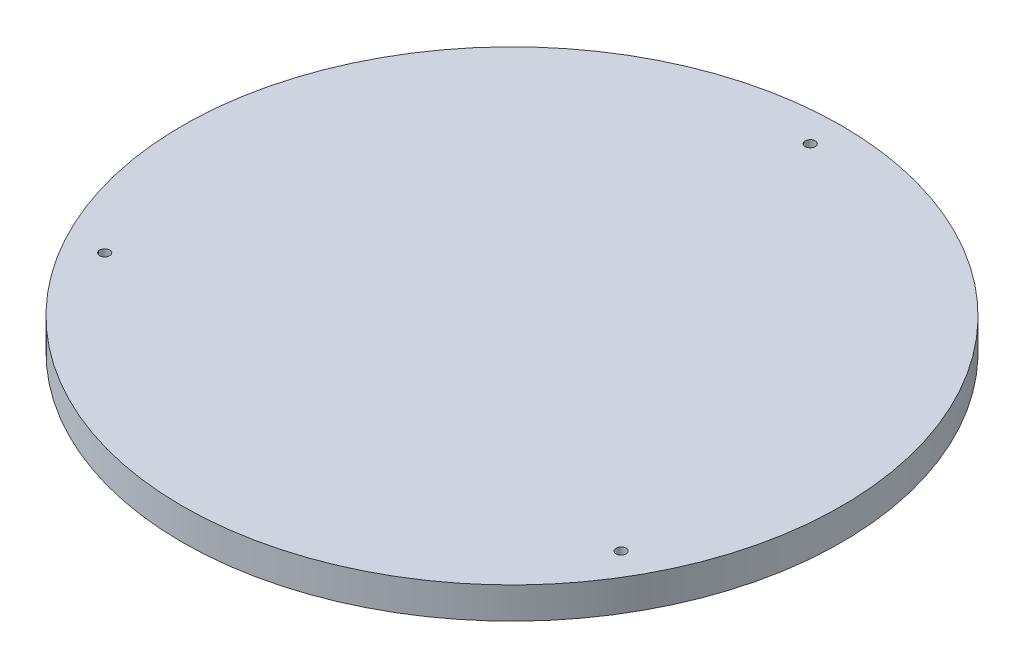
ISO-10303-21;
HEADER;
FILE_DESCRIPTION(('STEP AP214'),'2;1');
FILE_NAME('part.step','',(''),(''),'','','');
FILE_SCHEMA(('AUTOMOTIVE_DESIGN { 1 0 10303 214 1 1 1 1 }'));
ENDSEC;
DATA;
#1=APPLICATION_CONTEXT('core data for automotive mechanical design processes');
#2=APPLICATION_PROTOCOL_DEFINITION('international standard','automotive_design',2000,#1);
#3=PRODUCT_CONTEXT('',#1,'mechanical');
#4=PRODUCT('Part','Part','',(#3));
#5=PRODUCT_RELATED_PRODUCT_CATEGORY('part','',(#4));
#6=PRODUCT_DEFINITION_FORMATION('','',#4);
#7=PRODUCT_DEFINITION_CONTEXT('part definition',#1,'design');
#8=PRODUCT_DEFINITION('design','',#6,#7);
#9=PRODUCT_DEFINITION_SHAPE('','',#8);
#10=(LENGTH_UNIT() NAMED_UNIT(*) SI_UNIT(.MILLI.,.METRE.));
#11=(NAMED_UNIT(*) PLANE_ANGLE_UNIT() SI_UNIT($,.RADIAN.));
#12=(NAMED_UNIT(*) SI_UNIT($,.STERADIAN.) SOLID_ANGLE_UNIT());
#13=UNCERTAINTY_MEASURE_WITH_UNIT(LENGTH_MEASURE(1.E-05),#10,'distance_accuracy_value','');
#14=(GEOMETRIC_REPRESENTATION_CONTEXT(3) GLOBAL_UNCERTAINTY_ASSIGNED_CONTEXT((#13)) GLOBAL_UNIT_ASSIGNED_CONTEXT((#10,
#11,#12)) REPRESENTATION_CONTEXT('',''));
#15=CARTESIAN_POINT('',(0.,0.,0.));
#16=DIRECTION('',(0.,0.,1.));
#17=DIRECTION('',(1.,0.,0.));
#18=AXIS2_PLACEMENT_3D('',#15,#16,#17);
#19=CARTESIAN_POINT('',(0.,10.,0.));
#20=DIRECTION('',(0.,-1.,0.));
#21=DIRECTION('',(0.,0.,-1.));
#22=AXIS2_PLACEMENT_3D('',#19,#20,#21);
#23=CYLINDRICAL_SURFACE('',#22,105.);
#24=CARTESIAN_POINT('',(0.,10.,0.));
#25=DIRECTION('',(0.,1.,0.));
#26=DIRECTION('',(0.,0.,1.));
#27=AXIS2_PLACEMENT_3D('',#24,#25,#26);
#28=CIRCLE('',#27,105.);
#29=CARTESIAN_POINT('',(0.,10.,105.));
#30=VERTEX_POINT('',#29);
#31=EDGE_CURVE('E10',#30,#30,#28,.T.);
#32=ORIENTED_EDGE('',*,*,#31,.F.);
#33=EDGE_LOOP('',(#32));
#34=FACE_BOUND('',#33,.T.);
#35=CARTESIAN_POINT('',(0.,0.,0.));
#36=DIRECTION('',(0.,1.,0.));
#37=DIRECTION('',(0.,0.,1.));
#38=AXIS2_PLACEMENT_3D('',#35,#36,#37);
#39=CIRCLE('',#38,105.);
#40=CARTESIAN_POINT('',(0.,0.,105.));
#41=VERTEX_POINT('',#40);
#42=EDGE_CURVE('E51',#41,#41,#39,.T.);
#43=ORIENTED_EDGE('',*,*,#42,.T.);
#44=EDGE_LOOP('',(#43));
#45=FACE_BOUND('',#44,.T.);
#46=ADVANCED_FACE('F43',(#34,#45),#23,.T.);
#47=CARTESIAN_POINT('',(0.,10.,0.));
#48=DIRECTION('',(0.,1.,0.));
#49=DIRECTION('',(0.,0.,1.));
#50=AXIS2_PLACEMENT_3D('',#47,#48,#49);
#51=PLANE('',#50);
#52=CARTESIAN_POINT('',(-82.2724133595214,10.,47.5000000000004));
#53=DIRECTION('',(0.,1.,0.));
#54=DIRECTION('',(0.,0.,1.));
#55=AXIS2_PLACEMENT_3D('',#52,#53,#54);
#56=CIRCLE('',#55,1.60000000000001);
#57=CARTESIAN_POINT('',(-82.2724133595214,10.,49.1000000000004));
#58=VERTEX_POINT('',#57);
#59=EDGE_CURVE('E66',#58,#58,#56,.T.);
#60=ORIENTED_EDGE('',*,*,#59,.F.);
#61=EDGE_LOOP('',(#60));
#62=FACE_BOUND('',#61,.T.);
#63=CARTESIAN_POINT('',(82.2724133595222,10.,47.4999999999992));
#64=DIRECTION('',(0.,1.,0.));
#65=DIRECTION('',(0.,0.,1.));
#66=AXIS2_PLACEMENT_3D('',#63,#64,#65);
#67=CIRCLE('',#66,1.60000000000001);
#68=CARTESIAN_POINT('',(82.2724133595222,10.,49.0999999999992));
#69=VERTEX_POINT('',#68);
#70=EDGE_CURVE('E115',#69,#69,#67,.T.);
#71=ORIENTED_EDGE('',*,*,#70,.F.);
#72=EDGE_LOOP('',(#71));
#73=FACE_BOUND('',#72,.T.);
#74=CARTESIAN_POINT('',(0.,10.,-95.));
#75=DIRECTION('',(0.,1.,0.));
#76=DIRECTION('',(0.,0.,1.));
#77=AXIS2_PLACEMENT_3D('',#74,#75,#76);
#78=CIRCLE('',#77,1.6);
#79=CARTESIAN_POINT('',(0.,10.,-93.4));
#80=VERTEX_POINT('',#79);
#81=EDGE_CURVE('E59',#80,#80,#78,.T.);
#82=ORIENTED_EDGE('',*,*,#81,.F.);
#83=EDGE_LOOP('',(#82));
#84=FACE_BOUND('',#83,.T.);
#85=ORIENTED_EDGE('',*,*,#31,.T.);
#86=EDGE_LOOP('',(#85));
#87=FACE_BOUND('',#86,.T.);
#88=ADVANCED_FACE('F90',(#62,#73,#84,#87),#51,.T.);
#89=CARTESIAN_POINT('',(0.,0.,0.));
#90=DIRECTION('',(0.,1.,0.));
#91=DIRECTION('',(0.,0.,1.));
#92=AXIS2_PLACEMENT_3D('',#89,#90,#91);
#93=PLANE('',#92);
#94=CARTESIAN_POINT('',(-82.2724133595214,0.,47.5000000000004));
#95=DIRECTION('',(0.,1.,0.));
#96=DIRECTION('',(0.,0.,1.));
#97=AXIS2_PLACEMENT_3D('',#94,#95,#96);
#98=CIRCLE('',#97,1.60000000000001);
#99=CARTESIAN_POINT('',(-82.2724133595214,0.,49.1000000000004));
#100=VERTEX_POINT('',#99);
#101=EDGE_CURVE('E46',#100,#100,#98,.T.);
#102=ORIENTED_EDGE('',*,*,#101,.T.);
#103=EDGE_LOOP('',(#102));
#104=FACE_BOUND('',#103,.T.);
#105=CARTESIAN_POINT('',(82.2724133595222,0.,47.4999999999992));
#106=DIRECTION('',(0.,1.,0.));
#107=DIRECTION('',(0.,0.,1.));
#108=AXIS2_PLACEMENT_3D('',#105,#106,#107);
#109=CIRCLE('',#108,1.60000000000001);
#110=CARTESIAN_POINT('',(82.2724133595222,0.,49.0999999999992));
#111=VERTEX_POINT('',#110);
#112=EDGE_CURVE('E65',#111,#111,#109,.T.);
#113=ORIENTED_EDGE('',*,*,#112,.T.);
#114=EDGE_LOOP('',(#113));
#115=FACE_BOUND('',#114,.T.);
#116=CARTESIAN_POINT('',(0.,0.,-95.));
#117=DIRECTION('',(0.,1.,0.));
#118=DIRECTION('',(0.,0.,1.));
#119=AXIS2_PLACEMENT_3D('',#116,#117,#118);
#120=CIRCLE('',#119,1.6);
#121=CARTESIAN_POINT('',(0.,0.,-93.4));
#122=VERTEX_POINT('',#121);
#123=EDGE_CURVE('E62',#122,#122,#120,.T.);
#124=ORIENTED_EDGE('',*,*,#123,.T.);
#125=EDGE_LOOP('',(#124));
#126=FACE_BOUND('',#125,.T.);
#127=ORIENTED_EDGE('',*,*,#42,.F.);
#128=EDGE_LOOP('',(#127));
#129=FACE_BOUND('',#128,.T.);
#130=ADVANCED_FACE('F75',(#104,#115,#126,#129),#93,.F.);
#131=CARTESIAN_POINT('',(0.,-37.,-95.));
#132=DIRECTION('',(0.,1.,0.));
#133=DIRECTION('',(0.,0.,1.));
#134=AXIS2_PLACEMENT_3D('',#131,#132,#133);
#135=CYLINDRICAL_SURFACE('',#134,1.6);
#136=ORIENTED_EDGE('',*,*,#81,.T.);
#137=EDGE_LOOP('',(#136));
#138=FACE_BOUND('',#137,.T.);
#139=ORIENTED_EDGE('',*,*,#123,.F.);
#140=EDGE_LOOP('',(#139));
#141=FACE_BOUND('',#140,.T.);
#142=ADVANCED_FACE('F85',(#138,#141),#135,.F.);
#143=CARTESIAN_POINT('',(82.2724133595222,-37.,47.4999999999992));
#144=DIRECTION('',(0.,1.,0.));
#145=DIRECTION('',(0.,0.,1.));
#146=AXIS2_PLACEMENT_3D('',#143,#144,#145);
#147=CYLINDRICAL_SURFACE('',#146,1.60000000000001);
#148=ORIENTED_EDGE('',*,*,#70,.T.);
#149=EDGE_LOOP('',(#148));
#150=FACE_BOUND('',#149,.T.);
#151=ORIENTED_EDGE('',*,*,#112,.F.);
#152=EDGE_LOOP('',(#151));
#153=FACE_BOUND('',#152,.T.);
#154=ADVANCED_FACE('F79',(#150,#153),#147,.F.);
#155=CARTESIAN_POINT('',(-82.2724133595214,-37.,47.5000000000004));
#156=DIRECTION('',(0.,1.,0.));
#157=DIRECTION('',(0.,0.,1.));
#158=AXIS2_PLACEMENT_3D('',#155,#156,#157);
#159=CYLINDRICAL_SURFACE('',#158,1.60000000000001);
#160=ORIENTED_EDGE('',*,*,#59,.T.);
#161=EDGE_LOOP('',(#160));
#162=FACE_BOUND('',#161,.T.);
#163=ORIENTED_EDGE('',*,*,#101,.F.);
#164=EDGE_LOOP('',(#163));
#165=FACE_BOUND('',#164,.T.);
#166=ADVANCED_FACE('F77',(#162,#165),#159,.F.);
#167=CLOSED_SHELL('',(#46,#88,#130,#142,#154,#166));
#168=MANIFOLD_SOLID_BREP('B2',#167);
#169=ADVANCED_BREP_SHAPE_REPRESENTATION('',(#18,#168),#14);
#170=SHAPE_DEFINITION_REPRESENTATION(#9,#169);
ENDSEC;
END-ISO-10303-21;
